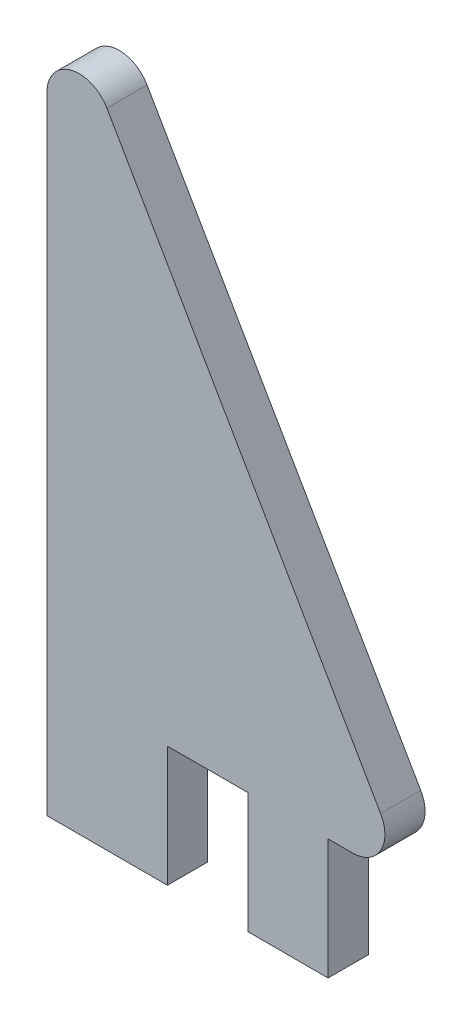
ISO-10303-21;
HEADER;
FILE_DESCRIPTION(('STEP AP214'),'2;1');
FILE_NAME('part.step','',(''),(''),'','','');
FILE_SCHEMA(('AUTOMOTIVE_DESIGN { 1 0 10303 214 1 1 1 1 }'));
ENDSEC;
DATA;
#1=APPLICATION_CONTEXT('core data for automotive mechanical design processes');
#2=APPLICATION_PROTOCOL_DEFINITION('international standard','automotive_design',2000,#1);
#3=PRODUCT_CONTEXT('',#1,'mechanical');
#4=PRODUCT('Part','Part','',(#3));
#5=PRODUCT_RELATED_PRODUCT_CATEGORY('part','',(#4));
#6=PRODUCT_DEFINITION_FORMATION('','',#4);
#7=PRODUCT_DEFINITION_CONTEXT('part definition',#1,'design');
#8=PRODUCT_DEFINITION('design','',#6,#7);
#9=PRODUCT_DEFINITION_SHAPE('','',#8);
#10=(LENGTH_UNIT() NAMED_UNIT(*) SI_UNIT(.MILLI.,.METRE.));
#11=(NAMED_UNIT(*) PLANE_ANGLE_UNIT() SI_UNIT($,.RADIAN.));
#12=(NAMED_UNIT(*) SI_UNIT($,.STERADIAN.) SOLID_ANGLE_UNIT());
#13=UNCERTAINTY_MEASURE_WITH_UNIT(LENGTH_MEASURE(1.E-05),#10,'distance_accuracy_value','');
#14=(GEOMETRIC_REPRESENTATION_CONTEXT(3) GLOBAL_UNCERTAINTY_ASSIGNED_CONTEXT((#13)) GLOBAL_UNIT_ASSIGNED_CONTEXT((#10,
#11,#12)) REPRESENTATION_CONTEXT('',''));
#15=CARTESIAN_POINT('',(0.,0.,0.));
#16=DIRECTION('',(0.,0.,1.));
#17=DIRECTION('',(1.,0.,0.));
#18=AXIS2_PLACEMENT_3D('',#15,#16,#17);
#19=CARTESIAN_POINT('',(0.,0.,3.175));
#20=DIRECTION('',(0.,-1.,0.));
#21=DIRECTION('',(0.,0.,-1.));
#22=AXIS2_PLACEMENT_3D('',#19,#20,#21);
#23=PLANE('',#22);
#24=DIRECTION('',(-1.,0.,0.));
#25=VECTOR('',#24,1.);
#26=CARTESIAN_POINT('',(0.,0.,0.));
#27=LINE('',#26,#25);
#28=CARTESIAN_POINT('',(24.175590948775,0.,0.));
#29=VERTEX_POINT('',#28);
#30=CARTESIAN_POINT('',(22.225,0.,0.));
#31=VERTEX_POINT('',#30);
#32=EDGE_CURVE('E156',#29,#31,#27,.T.);
#33=ORIENTED_EDGE('',*,*,#32,.F.);
#34=DIRECTION('',(0.,0.,-1.));
#35=VECTOR('',#34,1.);
#36=CARTESIAN_POINT('',(24.175590948775,0.,3.175));
#37=LINE('',#36,#35);
#38=CARTESIAN_POINT('',(24.175590948775,0.,3.175));
#39=VERTEX_POINT('',#38);
#40=EDGE_CURVE('E56',#29,#39,#37,.F.);
#41=ORIENTED_EDGE('',*,*,#40,.T.);
#42=DIRECTION('',(-1.,0.,0.));
#43=VECTOR('',#42,1.);
#44=CARTESIAN_POINT('',(0.,0.,3.175));
#45=LINE('',#44,#43);
#46=CARTESIAN_POINT('',(22.225,0.,3.175));
#47=VERTEX_POINT('',#46);
#48=EDGE_CURVE('E142',#39,#47,#45,.T.);
#49=ORIENTED_EDGE('',*,*,#48,.T.);
#50=DIRECTION('',(0.,0.,-1.));
#51=VECTOR('',#50,1.);
#52=CARTESIAN_POINT('',(22.225,0.,3.175));
#53=LINE('',#52,#51);
#54=EDGE_CURVE('E155',#47,#31,#53,.T.);
#55=ORIENTED_EDGE('',*,*,#54,.T.);
#56=EDGE_LOOP('',(#33,#41,#49,#55));
#57=FACE_BOUND('',#56,.T.);
#58=ADVANCED_FACE('F33',(#57),#23,.T.);
#59=CARTESIAN_POINT('',(21.4312499999999,12.3733379565702,3.175));
#60=DIRECTION('',(0.866025403784436,0.500000000000004,0.));
#61=DIRECTION('',(-0.500000000000004,0.866025403784436,0.));
#62=AXIS2_PLACEMENT_3D('',#59,#60,#61);
#63=PLANE('',#62);
#64=DIRECTION('',(0.500000000000004,-0.866025403784436,0.));
#65=VECTOR('',#64,1.);
#66=CARTESIAN_POINT('',(21.4312499999999,12.3733379565702,3.175));
#67=LINE('',#66,#65);
#68=CARTESIAN_POINT('',(4.73970452561247,41.2839427750552,3.175));
#69=VERTEX_POINT('',#68);
#70=CARTESIAN_POINT('',(26.3752954743875,3.81000000000001,3.175));
#71=VERTEX_POINT('',#70);
#72=EDGE_CURVE('E139',#69,#71,#67,.T.);
#73=ORIENTED_EDGE('',*,*,#72,.T.);
#74=DIRECTION('',(0.,0.,-1.));
#75=VECTOR('',#74,1.);
#76=CARTESIAN_POINT('',(26.3752954743875,3.81000000000001,3.175));
#77=LINE('',#76,#75);
#78=CARTESIAN_POINT('',(26.3752954743875,3.81000000000001,0.));
#79=VERTEX_POINT('',#78);
#80=EDGE_CURVE('E189',#71,#79,#77,.T.);
#81=ORIENTED_EDGE('',*,*,#80,.T.);
#82=DIRECTION('',(0.500000000000004,-0.866025403784436,0.));
#83=VECTOR('',#82,1.);
#84=CARTESIAN_POINT('',(21.4312499999999,12.3733379565702,0.));
#85=LINE('',#84,#83);
#86=CARTESIAN_POINT('',(4.73970452561247,41.2839427750552,0.));
#87=VERTEX_POINT('',#86);
#88=EDGE_CURVE('E158',#87,#79,#85,.T.);
#89=ORIENTED_EDGE('',*,*,#88,.F.);
#90=DIRECTION('',(0.,0.,-1.));
#91=VECTOR('',#90,1.);
#92=CARTESIAN_POINT('',(4.73970452561247,41.2839427750552,3.175));
#93=LINE('',#92,#91);
#94=EDGE_CURVE('E128',#87,#69,#93,.F.);
#95=ORIENTED_EDGE('',*,*,#94,.T.);
#96=EDGE_LOOP('',(#73,#81,#89,#95));
#97=FACE_BOUND('',#96,.T.);
#98=ADVANCED_FACE('F202',(#97),#63,.T.);
#99=CARTESIAN_POINT('',(0.,0.,3.175));
#100=DIRECTION('',(-1.,0.,0.));
#101=DIRECTION('',(0.,0.,1.));
#102=AXIS2_PLACEMENT_3D('',#99,#100,#101);
#103=PLANE('',#102);
#104=DIRECTION('',(0.,1.,0.));
#105=VECTOR('',#104,1.);
#106=CARTESIAN_POINT('',(0.,0.,3.175));
#107=LINE('',#106,#105);
#108=CARTESIAN_POINT('',(0.,-9.525,3.175));
#109=VERTEX_POINT('',#108);
#110=CARTESIAN_POINT('',(0.,40.0139427750552,3.175));
#111=VERTEX_POINT('',#110);
#112=EDGE_CURVE('E121',#109,#111,#107,.T.);
#113=ORIENTED_EDGE('',*,*,#112,.T.);
#114=DIRECTION('',(0.,0.,-1.));
#115=VECTOR('',#114,1.);
#116=CARTESIAN_POINT('',(0.,40.0139427750552,3.175));
#117=LINE('',#116,#115);
#118=CARTESIAN_POINT('',(0.,40.0139427750552,0.));
#119=VERTEX_POINT('',#118);
#120=EDGE_CURVE('E11',#111,#119,#117,.T.);
#121=ORIENTED_EDGE('',*,*,#120,.T.);
#122=DIRECTION('',(0.,1.,0.));
#123=VECTOR('',#122,1.);
#124=CARTESIAN_POINT('',(0.,0.,0.));
#125=LINE('',#124,#123);
#126=CARTESIAN_POINT('',(0.,-9.525,0.));
#127=VERTEX_POINT('',#126);
#128=EDGE_CURVE('E124',#127,#119,#125,.T.);
#129=ORIENTED_EDGE('',*,*,#128,.F.);
#130=DIRECTION('',(0.,0.,-1.));
#131=VECTOR('',#130,1.);
#132=CARTESIAN_POINT('',(0.,-9.525,3.175));
#133=LINE('',#132,#131);
#134=EDGE_CURVE('E118',#109,#127,#133,.T.);
#135=ORIENTED_EDGE('',*,*,#134,.F.);
#136=EDGE_LOOP('',(#113,#121,#129,#135));
#137=FACE_BOUND('',#136,.T.);
#138=ADVANCED_FACE('F120',(#137),#103,.T.);
#139=CARTESIAN_POINT('',(0.,-9.525,3.175));
#140=DIRECTION('',(0.,1.,0.));
#141=DIRECTION('',(0.,0.,1.));
#142=AXIS2_PLACEMENT_3D('',#139,#140,#141);
#143=PLANE('',#142);
#144=DIRECTION('',(1.,0.,0.));
#145=VECTOR('',#144,1.);
#146=CARTESIAN_POINT('',(0.,-9.525,0.));
#147=LINE('',#146,#145);
#148=CARTESIAN_POINT('',(9.525,-9.525,0.));
#149=VERTEX_POINT('',#148);
#150=EDGE_CURVE('E163',#127,#149,#147,.T.);
#151=ORIENTED_EDGE('',*,*,#150,.T.);
#152=DIRECTION('',(0.,0.,-1.));
#153=VECTOR('',#152,1.);
#154=CARTESIAN_POINT('',(9.525,-9.525,3.175));
#155=LINE('',#154,#153);
#156=CARTESIAN_POINT('',(9.525,-9.525,3.175));
#157=VERTEX_POINT('',#156);
#158=EDGE_CURVE('E129',#157,#149,#155,.T.);
#159=ORIENTED_EDGE('',*,*,#158,.F.);
#160=DIRECTION('',(1.,0.,0.));
#161=VECTOR('',#160,1.);
#162=CARTESIAN_POINT('',(0.,-9.525,3.175));
#163=LINE('',#162,#161);
#164=EDGE_CURVE('E132',#109,#157,#163,.T.);
#165=ORIENTED_EDGE('',*,*,#164,.F.);
#166=ORIENTED_EDGE('',*,*,#134,.T.);
#167=EDGE_LOOP('',(#151,#159,#165,#166));
#168=FACE_BOUND('',#167,.T.);
#169=ADVANCED_FACE('F133',(#168),#143,.F.);
#170=CARTESIAN_POINT('',(9.525,0.,3.175));
#171=DIRECTION('',(1.,0.,0.));
#172=DIRECTION('',(0.,1.,0.));
#173=AXIS2_PLACEMENT_3D('',#170,#171,#172);
#174=PLANE('',#173);
#175=DIRECTION('',(0.,-1.,0.));
#176=VECTOR('',#175,1.);
#177=CARTESIAN_POINT('',(9.525,0.,0.));
#178=LINE('',#177,#176);
#179=CARTESIAN_POINT('',(9.525,0.,0.));
#180=VERTEX_POINT('',#179);
#181=EDGE_CURVE('E165',#180,#149,#178,.T.);
#182=ORIENTED_EDGE('',*,*,#181,.F.);
#183=DIRECTION('',(0.,0.,-1.));
#184=VECTOR('',#183,1.);
#185=CARTESIAN_POINT('',(9.525,0.,3.175));
#186=LINE('',#185,#184);
#187=CARTESIAN_POINT('',(9.525,0.,3.175));
#188=VERTEX_POINT('',#187);
#189=EDGE_CURVE('E185',#188,#180,#186,.T.);
#190=ORIENTED_EDGE('',*,*,#189,.F.);
#191=DIRECTION('',(0.,-1.,0.));
#192=VECTOR('',#191,1.);
#193=CARTESIAN_POINT('',(9.525,0.,3.175));
#194=LINE('',#193,#192);
#195=EDGE_CURVE('E136',#188,#157,#194,.T.);
#196=ORIENTED_EDGE('',*,*,#195,.T.);
#197=ORIENTED_EDGE('',*,*,#158,.T.);
#198=EDGE_LOOP('',(#182,#190,#196,#197));
#199=FACE_BOUND('',#198,.T.);
#200=ADVANCED_FACE('F230',(#199),#174,.T.);
#201=CARTESIAN_POINT('',(15.875,0.,0.));
#202=VERTEX_POINT('',#201);
#203=EDGE_CURVE('E159',#202,#180,#27,.T.);
#204=ORIENTED_EDGE('',*,*,#203,.F.);
#205=DIRECTION('',(0.,0.,-1.));
#206=VECTOR('',#205,1.);
#207=CARTESIAN_POINT('',(15.875,0.,3.175));
#208=LINE('',#207,#206);
#209=CARTESIAN_POINT('',(15.875,0.,3.175));
#210=VERTEX_POINT('',#209);
#211=EDGE_CURVE('E183',#210,#202,#208,.T.);
#212=ORIENTED_EDGE('',*,*,#211,.F.);
#213=EDGE_CURVE('E147',#210,#188,#45,.T.);
#214=ORIENTED_EDGE('',*,*,#213,.T.);
#215=ORIENTED_EDGE('',*,*,#189,.T.);
#216=EDGE_LOOP('',(#204,#212,#214,#215));
#217=FACE_BOUND('',#216,.T.);
#218=ADVANCED_FACE('F227',(#217),#23,.T.);
#219=CARTESIAN_POINT('',(15.875,0.,3.175));
#220=DIRECTION('',(1.,0.,0.));
#221=DIRECTION('',(0.,0.,-1.));
#222=AXIS2_PLACEMENT_3D('',#219,#220,#221);
#223=PLANE('',#222);
#224=DIRECTION('',(0.,-1.,0.));
#225=VECTOR('',#224,1.);
#226=CARTESIAN_POINT('',(15.875,0.,0.));
#227=LINE('',#226,#225);
#228=CARTESIAN_POINT('',(15.875,-9.525,0.));
#229=VERTEX_POINT('',#228);
#230=EDGE_CURVE('E168',#202,#229,#227,.T.);
#231=ORIENTED_EDGE('',*,*,#230,.T.);
#232=DIRECTION('',(0.,0.,-1.));
#233=VECTOR('',#232,1.);
#234=CARTESIAN_POINT('',(15.875,-9.525,3.175));
#235=LINE('',#234,#233);
#236=CARTESIAN_POINT('',(15.875,-9.525,3.175));
#237=VERTEX_POINT('',#236);
#238=EDGE_CURVE('E180',#237,#229,#235,.T.);
#239=ORIENTED_EDGE('',*,*,#238,.F.);
#240=DIRECTION('',(0.,-1.,0.));
#241=VECTOR('',#240,1.);
#242=CARTESIAN_POINT('',(15.875,0.,3.175));
#243=LINE('',#242,#241);
#244=EDGE_CURVE('E148',#210,#237,#243,.T.);
#245=ORIENTED_EDGE('',*,*,#244,.F.);
#246=ORIENTED_EDGE('',*,*,#211,.T.);
#247=EDGE_LOOP('',(#231,#239,#245,#246));
#248=FACE_BOUND('',#247,.T.);
#249=ADVANCED_FACE('F223',(#248),#223,.F.);
#250=CARTESIAN_POINT('',(0.,-9.52499999999999,3.175));
#251=DIRECTION('',(0.,1.,0.));
#252=DIRECTION('',(-1.,0.,0.));
#253=AXIS2_PLACEMENT_3D('',#250,#251,#252);
#254=PLANE('',#253);
#255=DIRECTION('',(1.,0.,0.));
#256=VECTOR('',#255,1.);
#257=CARTESIAN_POINT('',(0.,-9.52499999999999,0.));
#258=LINE('',#257,#256);
#259=CARTESIAN_POINT('',(22.225,-9.525,0.));
#260=VERTEX_POINT('',#259);
#261=EDGE_CURVE('E170',#229,#260,#258,.T.);
#262=ORIENTED_EDGE('',*,*,#261,.T.);
#263=DIRECTION('',(0.,0.,-1.));
#264=VECTOR('',#263,1.);
#265=CARTESIAN_POINT('',(22.225,-9.525,3.175));
#266=LINE('',#265,#264);
#267=CARTESIAN_POINT('',(22.225,-9.525,3.175));
#268=VERTEX_POINT('',#267);
#269=EDGE_CURVE('E178',#268,#260,#266,.T.);
#270=ORIENTED_EDGE('',*,*,#269,.F.);
#271=DIRECTION('',(1.,0.,0.));
#272=VECTOR('',#271,1.);
#273=CARTESIAN_POINT('',(0.,-9.52499999999999,3.175));
#274=LINE('',#273,#272);
#275=EDGE_CURVE('E150',#237,#268,#274,.T.);
#276=ORIENTED_EDGE('',*,*,#275,.F.);
#277=ORIENTED_EDGE('',*,*,#238,.T.);
#278=EDGE_LOOP('',(#262,#270,#276,#277));
#279=FACE_BOUND('',#278,.T.);
#280=ADVANCED_FACE('F218',(#279),#254,.F.);
#281=CARTESIAN_POINT('',(22.225,0.,3.175));
#282=DIRECTION('',(1.,0.,0.));
#283=DIRECTION('',(0.,0.,-1.));
#284=AXIS2_PLACEMENT_3D('',#281,#282,#283);
#285=PLANE('',#284);
#286=DIRECTION('',(0.,-1.,0.));
#287=VECTOR('',#286,1.);
#288=CARTESIAN_POINT('',(22.225,0.,0.));
#289=LINE('',#288,#287);
#290=EDGE_CURVE('E173',#31,#260,#289,.T.);
#291=ORIENTED_EDGE('',*,*,#290,.F.);
#292=ORIENTED_EDGE('',*,*,#54,.F.);
#293=DIRECTION('',(0.,-1.,0.));
#294=VECTOR('',#293,1.);
#295=CARTESIAN_POINT('',(22.225,0.,3.175));
#296=LINE('',#295,#294);
#297=EDGE_CURVE('E152',#47,#268,#296,.T.);
#298=ORIENTED_EDGE('',*,*,#297,.T.);
#299=ORIENTED_EDGE('',*,*,#269,.T.);
#300=EDGE_LOOP('',(#291,#292,#298,#299));
#301=FACE_BOUND('',#300,.T.);
#302=ADVANCED_FACE('F211',(#301),#285,.T.);
#303=CARTESIAN_POINT('',(0.,0.,3.175));
#304=DIRECTION('',(0.,0.,1.));
#305=DIRECTION('',(1.,0.,0.));
#306=AXIS2_PLACEMENT_3D('',#303,#304,#305);
#307=PLANE('',#306);
#308=ORIENTED_EDGE('',*,*,#48,.F.);
#309=CARTESIAN_POINT('',(24.175590948775,2.54,3.175));
#310=DIRECTION('',(0.,0.,1.));
#311=DIRECTION('',(1.,0.,0.));
#312=AXIS2_PLACEMENT_3D('',#309,#310,#311);
#313=CIRCLE('',#312,2.54);
#314=EDGE_CURVE('E41',#39,#71,#313,.T.);
#315=ORIENTED_EDGE('',*,*,#314,.T.);
#316=ORIENTED_EDGE('',*,*,#72,.F.);
#317=CARTESIAN_POINT('',(2.54,40.0139427750552,3.175));
#318=DIRECTION('',(0.,0.,1.));
#319=DIRECTION('',(1.,0.,0.));
#320=AXIS2_PLACEMENT_3D('',#317,#318,#319);
#321=CIRCLE('',#320,2.54);
#322=EDGE_CURVE('E48',#69,#111,#321,.T.);
#323=ORIENTED_EDGE('',*,*,#322,.T.);
#324=ORIENTED_EDGE('',*,*,#112,.F.);
#325=ORIENTED_EDGE('',*,*,#164,.T.);
#326=ORIENTED_EDGE('',*,*,#195,.F.);
#327=ORIENTED_EDGE('',*,*,#213,.F.);
#328=ORIENTED_EDGE('',*,*,#244,.T.);
#329=ORIENTED_EDGE('',*,*,#275,.T.);
#330=ORIENTED_EDGE('',*,*,#297,.F.);
#331=EDGE_LOOP('',(#308,#315,#316,#323,#324,#325,#326,#327,#328,#329,#330));
#332=FACE_BOUND('',#331,.T.);
#333=ADVANCED_FACE('F138',(#332),#307,.T.);
#334=CARTESIAN_POINT('',(0.,0.,0.));
#335=DIRECTION('',(0.,0.,1.));
#336=DIRECTION('',(1.,0.,0.));
#337=AXIS2_PLACEMENT_3D('',#334,#335,#336);
#338=PLANE('',#337);
#339=ORIENTED_EDGE('',*,*,#88,.T.);
#340=CARTESIAN_POINT('',(24.175590948775,2.54,0.));
#341=DIRECTION('',(0.,0.,1.));
#342=DIRECTION('',(1.,0.,0.));
#343=AXIS2_PLACEMENT_3D('',#340,#341,#342);
#344=CIRCLE('',#343,2.54);
#345=EDGE_CURVE('E194',#79,#29,#344,.F.);
#346=ORIENTED_EDGE('',*,*,#345,.T.);
#347=ORIENTED_EDGE('',*,*,#32,.T.);
#348=ORIENTED_EDGE('',*,*,#290,.T.);
#349=ORIENTED_EDGE('',*,*,#261,.F.);
#350=ORIENTED_EDGE('',*,*,#230,.F.);
#351=ORIENTED_EDGE('',*,*,#203,.T.);
#352=ORIENTED_EDGE('',*,*,#181,.T.);
#353=ORIENTED_EDGE('',*,*,#150,.F.);
#354=ORIENTED_EDGE('',*,*,#128,.T.);
#355=CARTESIAN_POINT('',(2.54,40.0139427750552,0.));
#356=DIRECTION('',(0.,0.,1.));
#357=DIRECTION('',(1.,0.,0.));
#358=AXIS2_PLACEMENT_3D('',#355,#356,#357);
#359=CIRCLE('',#358,2.54);
#360=EDGE_CURVE('E192',#119,#87,#359,.F.);
#361=ORIENTED_EDGE('',*,*,#360,.T.);
#362=EDGE_LOOP('',(#339,#346,#347,#348,#349,#350,#351,#352,#353,#354,#361));
#363=FACE_BOUND('',#362,.T.);
#364=ADVANCED_FACE('F207',(#363),#338,.F.);
#365=CARTESIAN_POINT('',(24.175590948775,2.54,3.175));
#366=DIRECTION('',(0.,0.,-1.));
#367=DIRECTION('',(-1.,0.,0.));
#368=AXIS2_PLACEMENT_3D('',#365,#366,#367);
#369=CYLINDRICAL_SURFACE('',#368,2.54);
#370=ORIENTED_EDGE('',*,*,#314,.F.);
#371=ORIENTED_EDGE('',*,*,#40,.F.);
#372=ORIENTED_EDGE('',*,*,#345,.F.);
#373=ORIENTED_EDGE('',*,*,#80,.F.);
#374=EDGE_LOOP('',(#370,#371,#372,#373));
#375=FACE_BOUND('',#374,.T.);
#376=ADVANCED_FACE('F205',(#375),#369,.T.);
#377=CARTESIAN_POINT('',(2.54,40.0139427750552,3.175));
#378=DIRECTION('',(0.,0.,-1.));
#379=DIRECTION('',(-1.,0.,0.));
#380=AXIS2_PLACEMENT_3D('',#377,#378,#379);
#381=CYLINDRICAL_SURFACE('',#380,2.54);
#382=ORIENTED_EDGE('',*,*,#322,.F.);
#383=ORIENTED_EDGE('',*,*,#94,.F.);
#384=ORIENTED_EDGE('',*,*,#360,.F.);
#385=ORIENTED_EDGE('',*,*,#120,.F.);
#386=EDGE_LOOP('',(#382,#383,#384,#385));
#387=FACE_BOUND('',#386,.T.);
#388=ADVANCED_FACE('F35',(#387),#381,.T.);
#389=CLOSED_SHELL('',(#58,#98,#138,#169,#200,#218,#249,#280,#302,#333,#364,#376,#388));
#390=MANIFOLD_SOLID_BREP('B2',#389);
#391=ADVANCED_BREP_SHAPE_REPRESENTATION('',(#18,#390),#14);
#392=SHAPE_DEFINITION_REPRESENTATION(#9,#391);
ENDSEC;
END-ISO-10303-21;
